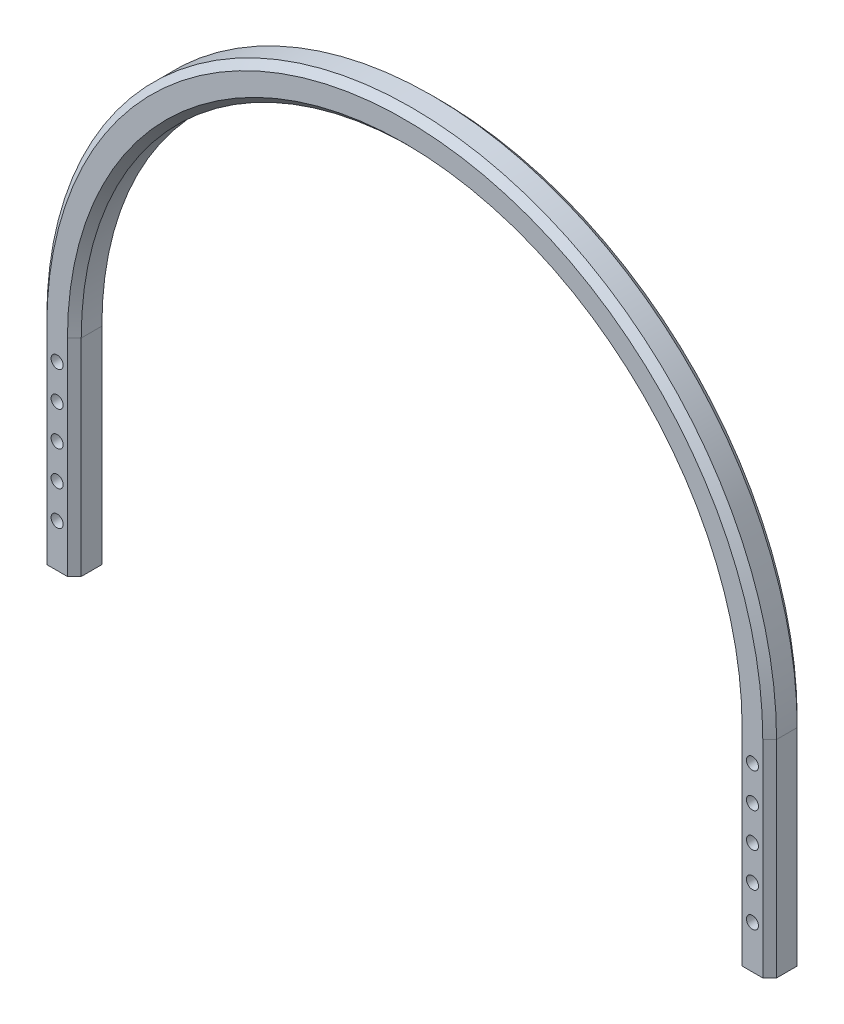
ISO-10303-21;
HEADER;
FILE_DESCRIPTION(('STEP AP214'),'2;1');
FILE_NAME('part.step','',(''),(''),'','','');
FILE_SCHEMA(('AUTOMOTIVE_DESIGN { 1 0 10303 214 1 1 1 1 }'));
ENDSEC;
DATA;
#1=APPLICATION_CONTEXT('core data for automotive mechanical design processes');
#2=APPLICATION_PROTOCOL_DEFINITION('international standard','automotive_design',2000,#1);
#3=PRODUCT_CONTEXT('',#1,'mechanical');
#4=PRODUCT('Part','Part','',(#3));
#5=PRODUCT_RELATED_PRODUCT_CATEGORY('part','',(#4));
#6=PRODUCT_DEFINITION_FORMATION('','',#4);
#7=PRODUCT_DEFINITION_CONTEXT('part definition',#1,'design');
#8=PRODUCT_DEFINITION('design','',#6,#7);
#9=PRODUCT_DEFINITION_SHAPE('','',#8);
#10=(LENGTH_UNIT() NAMED_UNIT(*) SI_UNIT(.MILLI.,.METRE.));
#11=(NAMED_UNIT(*) PLANE_ANGLE_UNIT() SI_UNIT($,.RADIAN.));
#12=(NAMED_UNIT(*) SI_UNIT($,.STERADIAN.) SOLID_ANGLE_UNIT());
#13=UNCERTAINTY_MEASURE_WITH_UNIT(LENGTH_MEASURE(1.E-05),#10,'distance_accuracy_value','');
#14=(GEOMETRIC_REPRESENTATION_CONTEXT(3) GLOBAL_UNCERTAINTY_ASSIGNED_CONTEXT((#13)) GLOBAL_UNIT_ASSIGNED_CONTEXT((#10,
#11,#12)) REPRESENTATION_CONTEXT('',''));
#15=CARTESIAN_POINT('',(0.,0.,0.));
#16=DIRECTION('',(0.,0.,1.));
#17=DIRECTION('',(1.,0.,0.));
#18=AXIS2_PLACEMENT_3D('',#15,#16,#17);
#19=CARTESIAN_POINT('',(101.,52.5,0.));
#20=DIRECTION('',(0.,0.,1.));
#21=DIRECTION('',(1.,0.,0.));
#22=AXIS2_PLACEMENT_3D('',#19,#20,#21);
#23=CYLINDRICAL_SURFACE('',#22,1.75);
#24=CARTESIAN_POINT('',(101.,52.5,0.));
#25=DIRECTION('',(0.,0.,1.));
#26=DIRECTION('',(-1.,0.,0.));
#27=AXIS2_PLACEMENT_3D('',#24,#25,#26);
#28=CIRCLE('',#27,1.75);
#29=CARTESIAN_POINT('',(99.25,52.5,0.));
#30=VERTEX_POINT('',#29);
#31=EDGE_CURVE('E48',#30,#30,#28,.T.);
#32=ORIENTED_EDGE('',*,*,#31,.F.);
#33=EDGE_LOOP('',(#32));
#34=FACE_BOUND('',#33,.T.);
#35=CARTESIAN_POINT('',(101.,52.5,10.));
#36=DIRECTION('',(0.,0.,1.));
#37=DIRECTION('',(-1.,0.,0.));
#38=AXIS2_PLACEMENT_3D('',#35,#36,#37);
#39=CIRCLE('',#38,1.75);
#40=CARTESIAN_POINT('',(99.25,52.5,10.));
#41=VERTEX_POINT('',#40);
#42=EDGE_CURVE('E11',#41,#41,#39,.T.);
#43=ORIENTED_EDGE('',*,*,#42,.T.);
#44=EDGE_LOOP('',(#43));
#45=FACE_BOUND('',#44,.T.);
#46=ADVANCED_FACE('F41',(#34,#45),#23,.F.);
#47=CARTESIAN_POINT('',(101.,42.5,0.));
#48=DIRECTION('',(0.,0.,1.));
#49=DIRECTION('',(1.,0.,0.));
#50=AXIS2_PLACEMENT_3D('',#47,#48,#49);
#51=CYLINDRICAL_SURFACE('',#50,1.75);
#52=CARTESIAN_POINT('',(101.,42.5,0.));
#53=DIRECTION('',(0.,0.,1.));
#54=DIRECTION('',(-1.,0.,0.));
#55=AXIS2_PLACEMENT_3D('',#52,#53,#54);
#56=CIRCLE('',#55,1.75);
#57=CARTESIAN_POINT('',(99.25,42.5,0.));
#58=VERTEX_POINT('',#57);
#59=EDGE_CURVE('E223',#58,#58,#56,.T.);
#60=ORIENTED_EDGE('',*,*,#59,.F.);
#61=EDGE_LOOP('',(#60));
#62=FACE_BOUND('',#61,.T.);
#63=CARTESIAN_POINT('',(101.,42.5,10.));
#64=DIRECTION('',(0.,0.,1.));
#65=DIRECTION('',(-1.,0.,0.));
#66=AXIS2_PLACEMENT_3D('',#63,#64,#65);
#67=CIRCLE('',#66,1.75);
#68=CARTESIAN_POINT('',(99.25,42.5,10.));
#69=VERTEX_POINT('',#68);
#70=EDGE_CURVE('E226',#69,#69,#67,.T.);
#71=ORIENTED_EDGE('',*,*,#70,.T.);
#72=EDGE_LOOP('',(#71));
#73=FACE_BOUND('',#72,.T.);
#74=ADVANCED_FACE('F235',(#62,#73),#51,.F.);
#75=CARTESIAN_POINT('',(101.,32.5,0.));
#76=DIRECTION('',(0.,0.,1.));
#77=DIRECTION('',(1.,0.,0.));
#78=AXIS2_PLACEMENT_3D('',#75,#76,#77);
#79=CYLINDRICAL_SURFACE('',#78,1.75);
#80=CARTESIAN_POINT('',(101.,32.5,0.));
#81=DIRECTION('',(0.,0.,1.));
#82=DIRECTION('',(-1.,0.,0.));
#83=AXIS2_PLACEMENT_3D('',#80,#81,#82);
#84=CIRCLE('',#83,1.75);
#85=CARTESIAN_POINT('',(99.25,32.5,0.));
#86=VERTEX_POINT('',#85);
#87=EDGE_CURVE('E217',#86,#86,#84,.T.);
#88=ORIENTED_EDGE('',*,*,#87,.F.);
#89=EDGE_LOOP('',(#88));
#90=FACE_BOUND('',#89,.T.);
#91=CARTESIAN_POINT('',(101.,32.5,10.));
#92=DIRECTION('',(0.,0.,1.));
#93=DIRECTION('',(-1.,0.,0.));
#94=AXIS2_PLACEMENT_3D('',#91,#92,#93);
#95=CIRCLE('',#94,1.75);
#96=CARTESIAN_POINT('',(99.25,32.5,10.));
#97=VERTEX_POINT('',#96);
#98=EDGE_CURVE('E220',#97,#97,#95,.T.);
#99=ORIENTED_EDGE('',*,*,#98,.T.);
#100=EDGE_LOOP('',(#99));
#101=FACE_BOUND('',#100,.T.);
#102=ADVANCED_FACE('F372',(#90,#101),#79,.F.);
#103=CARTESIAN_POINT('',(-101.,52.5,0.));
#104=DIRECTION('',(0.,0.,1.));
#105=DIRECTION('',(1.,0.,0.));
#106=AXIS2_PLACEMENT_3D('',#103,#104,#105);
#107=CYLINDRICAL_SURFACE('',#106,1.75);
#108=CARTESIAN_POINT('',(-101.,52.5,0.));
#109=DIRECTION('',(0.,0.,1.));
#110=DIRECTION('',(1.,0.,0.));
#111=AXIS2_PLACEMENT_3D('',#108,#109,#110);
#112=CIRCLE('',#111,1.75);
#113=CARTESIAN_POINT('',(-99.25,52.5,0.));
#114=VERTEX_POINT('',#113);
#115=EDGE_CURVE('E211',#114,#114,#112,.T.);
#116=ORIENTED_EDGE('',*,*,#115,.F.);
#117=EDGE_LOOP('',(#116));
#118=FACE_BOUND('',#117,.T.);
#119=CARTESIAN_POINT('',(-101.,52.5,10.));
#120=DIRECTION('',(0.,0.,1.));
#121=DIRECTION('',(1.,0.,0.));
#122=AXIS2_PLACEMENT_3D('',#119,#120,#121);
#123=CIRCLE('',#122,1.75);
#124=CARTESIAN_POINT('',(-99.25,52.5,10.));
#125=VERTEX_POINT('',#124);
#126=EDGE_CURVE('E214',#125,#125,#123,.T.);
#127=ORIENTED_EDGE('',*,*,#126,.T.);
#128=EDGE_LOOP('',(#127));
#129=FACE_BOUND('',#128,.T.);
#130=ADVANCED_FACE('F368',(#118,#129),#107,.F.);
#131=CARTESIAN_POINT('',(-101.,42.5,0.));
#132=DIRECTION('',(0.,0.,1.));
#133=DIRECTION('',(1.,0.,0.));
#134=AXIS2_PLACEMENT_3D('',#131,#132,#133);
#135=CYLINDRICAL_SURFACE('',#134,1.75);
#136=CARTESIAN_POINT('',(-101.,42.5,0.));
#137=DIRECTION('',(0.,0.,1.));
#138=DIRECTION('',(1.,0.,0.));
#139=AXIS2_PLACEMENT_3D('',#136,#137,#138);
#140=CIRCLE('',#139,1.75);
#141=CARTESIAN_POINT('',(-99.25,42.5,0.));
#142=VERTEX_POINT('',#141);
#143=EDGE_CURVE('E205',#142,#142,#140,.T.);
#144=ORIENTED_EDGE('',*,*,#143,.F.);
#145=EDGE_LOOP('',(#144));
#146=FACE_BOUND('',#145,.T.);
#147=CARTESIAN_POINT('',(-101.,42.5,10.));
#148=DIRECTION('',(0.,0.,1.));
#149=DIRECTION('',(1.,0.,0.));
#150=AXIS2_PLACEMENT_3D('',#147,#148,#149);
#151=CIRCLE('',#150,1.75);
#152=CARTESIAN_POINT('',(-99.25,42.5,10.));
#153=VERTEX_POINT('',#152);
#154=EDGE_CURVE('E208',#153,#153,#151,.T.);
#155=ORIENTED_EDGE('',*,*,#154,.T.);
#156=EDGE_LOOP('',(#155));
#157=FACE_BOUND('',#156,.T.);
#158=ADVANCED_FACE('F364',(#146,#157),#135,.F.);
#159=CARTESIAN_POINT('',(-101.,32.5,0.));
#160=DIRECTION('',(0.,0.,1.));
#161=DIRECTION('',(1.,0.,0.));
#162=AXIS2_PLACEMENT_3D('',#159,#160,#161);
#163=CYLINDRICAL_SURFACE('',#162,1.75);
#164=CARTESIAN_POINT('',(-101.,32.5,0.));
#165=DIRECTION('',(0.,0.,1.));
#166=DIRECTION('',(1.,0.,0.));
#167=AXIS2_PLACEMENT_3D('',#164,#165,#166);
#168=CIRCLE('',#167,1.75);
#169=CARTESIAN_POINT('',(-99.25,32.5,0.));
#170=VERTEX_POINT('',#169);
#171=EDGE_CURVE('E198',#170,#170,#168,.T.);
#172=ORIENTED_EDGE('',*,*,#171,.F.);
#173=EDGE_LOOP('',(#172));
#174=FACE_BOUND('',#173,.T.);
#175=CARTESIAN_POINT('',(-101.,32.5,10.));
#176=DIRECTION('',(0.,0.,1.));
#177=DIRECTION('',(1.,0.,0.));
#178=AXIS2_PLACEMENT_3D('',#175,#176,#177);
#179=CIRCLE('',#178,1.75);
#180=CARTESIAN_POINT('',(-99.25,32.5,10.));
#181=VERTEX_POINT('',#180);
#182=EDGE_CURVE('E201',#181,#181,#179,.T.);
#183=ORIENTED_EDGE('',*,*,#182,.T.);
#184=EDGE_LOOP('',(#183));
#185=FACE_BOUND('',#184,.T.);
#186=ADVANCED_FACE('F281',(#174,#185),#163,.F.);
#187=CARTESIAN_POINT('',(-106.,0.,10.));
#188=DIRECTION('',(0.,1.,0.));
#189=DIRECTION('',(0.,0.,1.));
#190=AXIS2_PLACEMENT_3D('',#187,#188,#189);
#191=PLANE('',#190);
#192=CARTESIAN_POINT('',(-101.,0.,5.));
#193=DIRECTION('',(0.,-1.,0.));
#194=DIRECTION('',(0.,0.,-1.));
#195=AXIS2_PLACEMENT_3D('',#192,#193,#194);
#196=CIRCLE('',#195,1.5);
#197=CARTESIAN_POINT('',(-101.,0.,3.5));
#198=VERTEX_POINT('',#197);
#199=EDGE_CURVE('E648',#198,#198,#196,.T.);
#200=ORIENTED_EDGE('',*,*,#199,.F.);
#201=EDGE_LOOP('',(#200));
#202=FACE_BOUND('',#201,.T.);
#203=DIRECTION('',(1.,0.,0.));
#204=VECTOR('',#203,1.);
#205=CARTESIAN_POINT('',(-106.,0.,0.));
#206=LINE('',#205,#204);
#207=CARTESIAN_POINT('',(-104.,0.,0.));
#208=VERTEX_POINT('',#207);
#209=CARTESIAN_POINT('',(-98.,0.,0.));
#210=VERTEX_POINT('',#209);
#211=EDGE_CURVE('E689',#208,#210,#206,.T.);
#212=ORIENTED_EDGE('',*,*,#211,.T.);
#213=DIRECTION('',(0.707106781186548,0.,0.707106781186548));
#214=VECTOR('',#213,1.);
#215=CARTESIAN_POINT('',(-96.,0.,2.));
#216=LINE('',#215,#214);
#217=CARTESIAN_POINT('',(-96.,0.,2.));
#218=VERTEX_POINT('',#217);
#219=EDGE_CURVE('E166',#210,#218,#216,.T.);
#220=ORIENTED_EDGE('',*,*,#219,.T.);
#221=DIRECTION('',(0.,0.,-1.));
#222=VECTOR('',#221,1.);
#223=CARTESIAN_POINT('',(-96.,0.,10.));
#224=LINE('',#223,#222);
#225=CARTESIAN_POINT('',(-96.,0.,8.));
#226=VERTEX_POINT('',#225);
#227=EDGE_CURVE('E176',#226,#218,#224,.T.);
#228=ORIENTED_EDGE('',*,*,#227,.F.);
#229=DIRECTION('',(0.707106781186543,0.,-0.707106781186552));
#230=VECTOR('',#229,1.);
#231=CARTESIAN_POINT('',(-98.,0.,10.));
#232=LINE('',#231,#230);
#233=CARTESIAN_POINT('',(-98.,0.,10.));
#234=VERTEX_POINT('',#233);
#235=EDGE_CURVE('E180',#226,#234,#232,.F.);
#236=ORIENTED_EDGE('',*,*,#235,.T.);
#237=DIRECTION('',(1.,0.,0.));
#238=VECTOR('',#237,1.);
#239=CARTESIAN_POINT('',(-106.,0.,10.));
#240=LINE('',#239,#238);
#241=CARTESIAN_POINT('',(-104.,0.,10.));
#242=VERTEX_POINT('',#241);
#243=EDGE_CURVE('E681',#242,#234,#240,.T.);
#244=ORIENTED_EDGE('',*,*,#243,.F.);
#245=DIRECTION('',(0.707106781186543,0.,0.707106781186552));
#246=VECTOR('',#245,1.);
#247=CARTESIAN_POINT('',(-104.,0.,10.));
#248=LINE('',#247,#246);
#249=CARTESIAN_POINT('',(-106.,0.,8.));
#250=VERTEX_POINT('',#249);
#251=EDGE_CURVE('E724',#242,#250,#248,.F.);
#252=ORIENTED_EDGE('',*,*,#251,.T.);
#253=DIRECTION('',(0.,0.,-1.));
#254=VECTOR('',#253,1.);
#255=CARTESIAN_POINT('',(-106.,0.,10.));
#256=LINE('',#255,#254);
#257=CARTESIAN_POINT('',(-106.,0.,2.));
#258=VERTEX_POINT('',#257);
#259=EDGE_CURVE('E688',#250,#258,#256,.T.);
#260=ORIENTED_EDGE('',*,*,#259,.T.);
#261=DIRECTION('',(0.707106781186548,0.,-0.707106781186548));
#262=VECTOR('',#261,1.);
#263=CARTESIAN_POINT('',(-106.,0.,2.));
#264=LINE('',#263,#262);
#265=EDGE_CURVE('E727',#258,#208,#264,.T.);
#266=ORIENTED_EDGE('',*,*,#265,.T.);
#267=EDGE_LOOP('',(#212,#220,#228,#236,#244,#252,#260,#266));
#268=FACE_BOUND('',#267,.T.);
#269=ADVANCED_FACE('F278',(#202,#268),#191,.F.);
#270=CARTESIAN_POINT('',(-96.,0.,10.));
#271=DIRECTION('',(-1.,0.,0.));
#272=DIRECTION('',(0.,0.,1.));
#273=AXIS2_PLACEMENT_3D('',#270,#271,#272);
#274=PLANE('',#273);
#275=ORIENTED_EDGE('',*,*,#227,.T.);
#276=DIRECTION('',(0.,1.,0.));
#277=VECTOR('',#276,1.);
#278=CARTESIAN_POINT('',(-96.,60.,2.));
#279=LINE('',#278,#277);
#280=CARTESIAN_POINT('',(-96.,60.,2.));
#281=VERTEX_POINT('',#280);
#282=EDGE_CURVE('E175',#218,#281,#279,.T.);
#283=ORIENTED_EDGE('',*,*,#282,.T.);
#284=DIRECTION('',(0.,0.,-1.));
#285=VECTOR('',#284,1.);
#286=CARTESIAN_POINT('',(-96.,60.,10.));
#287=LINE('',#286,#285);
#288=CARTESIAN_POINT('',(-96.,60.,8.));
#289=VERTEX_POINT('',#288);
#290=EDGE_CURVE('E159',#289,#281,#287,.T.);
#291=ORIENTED_EDGE('',*,*,#290,.F.);
#292=DIRECTION('',(0.,-1.,0.));
#293=VECTOR('',#292,1.);
#294=CARTESIAN_POINT('',(-96.,0.,8.));
#295=LINE('',#294,#293);
#296=EDGE_CURVE('E172',#289,#226,#295,.T.);
#297=ORIENTED_EDGE('',*,*,#296,.T.);
#298=EDGE_LOOP('',(#275,#283,#291,#297));
#299=FACE_BOUND('',#298,.T.);
#300=ADVANCED_FACE('F171',(#299),#274,.F.);
#301=CARTESIAN_POINT('',(0.,60.,10.));
#302=DIRECTION('',(0.,0.,-1.));
#303=DIRECTION('',(-1.,0.,0.));
#304=AXIS2_PLACEMENT_3D('',#301,#302,#303);
#305=CYLINDRICAL_SURFACE('',#304,96.);
#306=ORIENTED_EDGE('',*,*,#290,.T.);
#307=CARTESIAN_POINT('',(0.,60.,2.));
#308=DIRECTION('',(0.,0.,-1.));
#309=DIRECTION('',(-1.,0.,0.));
#310=AXIS2_PLACEMENT_3D('',#307,#308,#309);
#311=CIRCLE('',#310,96.);
#312=CARTESIAN_POINT('',(96.,60.,2.));
#313=VERTEX_POINT('',#312);
#314=EDGE_CURVE('E165',#281,#313,#311,.T.);
#315=ORIENTED_EDGE('',*,*,#314,.T.);
#316=DIRECTION('',(0.,0.,-1.));
#317=VECTOR('',#316,1.);
#318=CARTESIAN_POINT('',(96.,60.,10.));
#319=LINE('',#318,#317);
#320=CARTESIAN_POINT('',(96.,60.,8.));
#321=VERTEX_POINT('',#320);
#322=EDGE_CURVE('E161',#321,#313,#319,.T.);
#323=ORIENTED_EDGE('',*,*,#322,.F.);
#324=CARTESIAN_POINT('',(0.,60.,8.));
#325=DIRECTION('',(0.,0.,-1.));
#326=DIRECTION('',(-1.,0.,0.));
#327=AXIS2_PLACEMENT_3D('',#324,#325,#326);
#328=CIRCLE('',#327,96.);
#329=EDGE_CURVE('E156',#321,#289,#328,.F.);
#330=ORIENTED_EDGE('',*,*,#329,.T.);
#331=EDGE_LOOP('',(#306,#315,#323,#330));
#332=FACE_BOUND('',#331,.T.);
#333=ADVANCED_FACE('F158',(#332),#305,.F.);
#334=CARTESIAN_POINT('',(96.,60.,10.));
#335=DIRECTION('',(1.,0.,0.));
#336=DIRECTION('',(0.,0.,-1.));
#337=AXIS2_PLACEMENT_3D('',#334,#335,#336);
#338=PLANE('',#337);
#339=ORIENTED_EDGE('',*,*,#322,.T.);
#340=DIRECTION('',(0.,-1.,0.));
#341=VECTOR('',#340,1.);
#342=CARTESIAN_POINT('',(96.,0.,2.));
#343=LINE('',#342,#341);
#344=CARTESIAN_POINT('',(96.,0.,2.));
#345=VERTEX_POINT('',#344);
#346=EDGE_CURVE('E733',#313,#345,#343,.T.);
#347=ORIENTED_EDGE('',*,*,#346,.T.);
#348=DIRECTION('',(0.,0.,-1.));
#349=VECTOR('',#348,1.);
#350=CARTESIAN_POINT('',(96.,0.,10.));
#351=LINE('',#350,#349);
#352=CARTESIAN_POINT('',(96.,0.,8.));
#353=VERTEX_POINT('',#352);
#354=EDGE_CURVE('E706',#353,#345,#351,.T.);
#355=ORIENTED_EDGE('',*,*,#354,.F.);
#356=DIRECTION('',(0.,1.,0.));
#357=VECTOR('',#356,1.);
#358=CARTESIAN_POINT('',(96.,60.,8.));
#359=LINE('',#358,#357);
#360=EDGE_CURVE('E731',#353,#321,#359,.T.);
#361=ORIENTED_EDGE('',*,*,#360,.T.);
#362=EDGE_LOOP('',(#339,#347,#355,#361));
#363=FACE_BOUND('',#362,.T.);
#364=ADVANCED_FACE('F269',(#363),#338,.F.);
#365=CARTESIAN_POINT('',(96.,0.,10.));
#366=DIRECTION('',(0.,1.,0.));
#367=DIRECTION('',(-1.,0.,0.));
#368=AXIS2_PLACEMENT_3D('',#365,#366,#367);
#369=PLANE('',#368);
#370=CARTESIAN_POINT('',(101.,0.,5.));
#371=DIRECTION('',(0.,-1.,0.));
#372=DIRECTION('',(0.,0.,1.));
#373=AXIS2_PLACEMENT_3D('',#370,#371,#372);
#374=CIRCLE('',#373,1.5);
#375=CARTESIAN_POINT('',(101.,0.,6.5));
#376=VERTEX_POINT('',#375);
#377=EDGE_CURVE('E654',#376,#376,#374,.T.);
#378=ORIENTED_EDGE('',*,*,#377,.F.);
#379=EDGE_LOOP('',(#378));
#380=FACE_BOUND('',#379,.T.);
#381=ORIENTED_EDGE('',*,*,#354,.T.);
#382=DIRECTION('',(0.707106781186548,0.,-0.707106781186548));
#383=VECTOR('',#382,1.);
#384=CARTESIAN_POINT('',(96.,0.,2.00000000000001));
#385=LINE('',#384,#383);
#386=CARTESIAN_POINT('',(98.,0.,0.));
#387=VERTEX_POINT('',#386);
#388=EDGE_CURVE('E741',#345,#387,#385,.T.);
#389=ORIENTED_EDGE('',*,*,#388,.T.);
#390=DIRECTION('',(1.,0.,0.));
#391=VECTOR('',#390,1.);
#392=CARTESIAN_POINT('',(96.,0.,0.));
#393=LINE('',#392,#391);
#394=CARTESIAN_POINT('',(104.,0.,0.));
#395=VERTEX_POINT('',#394);
#396=EDGE_CURVE('E685',#387,#395,#393,.T.);
#397=ORIENTED_EDGE('',*,*,#396,.T.);
#398=DIRECTION('',(0.707106781186548,0.,0.707106781186548));
#399=VECTOR('',#398,1.);
#400=CARTESIAN_POINT('',(106.,0.,1.99999999999999));
#401=LINE('',#400,#399);
#402=CARTESIAN_POINT('',(106.,0.,2.));
#403=VERTEX_POINT('',#402);
#404=EDGE_CURVE('E739',#395,#403,#401,.T.);
#405=ORIENTED_EDGE('',*,*,#404,.T.);
#406=DIRECTION('',(0.,0.,-1.));
#407=VECTOR('',#406,1.);
#408=CARTESIAN_POINT('',(106.,0.,10.));
#409=LINE('',#408,#407);
#410=CARTESIAN_POINT('',(106.,0.,8.));
#411=VERTEX_POINT('',#410);
#412=EDGE_CURVE('E703',#411,#403,#409,.T.);
#413=ORIENTED_EDGE('',*,*,#412,.F.);
#414=DIRECTION('',(0.707106781186543,0.,-0.707106781186552));
#415=VECTOR('',#414,1.);
#416=CARTESIAN_POINT('',(104.,0.,10.));
#417=LINE('',#416,#415);
#418=CARTESIAN_POINT('',(104.,0.,10.));
#419=VERTEX_POINT('',#418);
#420=EDGE_CURVE('E735',#411,#419,#417,.F.);
#421=ORIENTED_EDGE('',*,*,#420,.T.);
#422=DIRECTION('',(1.,0.,0.));
#423=VECTOR('',#422,1.);
#424=CARTESIAN_POINT('',(96.,0.,10.));
#425=LINE('',#424,#423);
#426=CARTESIAN_POINT('',(98.,0.,10.));
#427=VERTEX_POINT('',#426);
#428=EDGE_CURVE('E684',#427,#419,#425,.T.);
#429=ORIENTED_EDGE('',*,*,#428,.F.);
#430=DIRECTION('',(0.707106781186543,0.,0.707106781186552));
#431=VECTOR('',#430,1.);
#432=CARTESIAN_POINT('',(98.,0.,9.99999999999999));
#433=LINE('',#432,#431);
#434=EDGE_CURVE('E737',#427,#353,#433,.F.);
#435=ORIENTED_EDGE('',*,*,#434,.T.);
#436=EDGE_LOOP('',(#381,#389,#397,#405,#413,#421,#429,#435));
#437=FACE_BOUND('',#436,.T.);
#438=ADVANCED_FACE('F265',(#380,#437),#369,.F.);
#439=CARTESIAN_POINT('',(106.,60.,10.));
#440=DIRECTION('',(-1.,0.,0.));
#441=DIRECTION('',(0.,0.,1.));
#442=AXIS2_PLACEMENT_3D('',#439,#440,#441);
#443=PLANE('',#442);
#444=ORIENTED_EDGE('',*,*,#412,.T.);
#445=DIRECTION('',(0.,1.,0.));
#446=VECTOR('',#445,1.);
#447=CARTESIAN_POINT('',(106.,60.0000000000001,2.));
#448=LINE('',#447,#446);
#449=CARTESIAN_POINT('',(106.,60.0000000000001,2.));
#450=VERTEX_POINT('',#449);
#451=EDGE_CURVE('E754',#403,#450,#448,.T.);
#452=ORIENTED_EDGE('',*,*,#451,.T.);
#453=DIRECTION('',(0.,0.,-1.));
#454=VECTOR('',#453,1.);
#455=CARTESIAN_POINT('',(106.,60.0000000000001,10.));
#456=LINE('',#455,#454);
#457=CARTESIAN_POINT('',(106.,60.0000000000001,8.));
#458=VERTEX_POINT('',#457);
#459=EDGE_CURVE('E700',#458,#450,#456,.T.);
#460=ORIENTED_EDGE('',*,*,#459,.F.);
#461=DIRECTION('',(0.,-1.,0.));
#462=VECTOR('',#461,1.);
#463=CARTESIAN_POINT('',(106.,60.,8.));
#464=LINE('',#463,#462);
#465=EDGE_CURVE('E752',#458,#411,#464,.T.);
#466=ORIENTED_EDGE('',*,*,#465,.T.);
#467=EDGE_LOOP('',(#444,#452,#460,#466));
#468=FACE_BOUND('',#467,.T.);
#469=ADVANCED_FACE('F261',(#468),#443,.F.);
#470=CARTESIAN_POINT('',(0.,60.,10.));
#471=DIRECTION('',(0.,0.,-1.));
#472=DIRECTION('',(-1.,0.,0.));
#473=AXIS2_PLACEMENT_3D('',#470,#471,#472);
#474=CYLINDRICAL_SURFACE('',#473,106.);
#475=ORIENTED_EDGE('',*,*,#459,.T.);
#476=CARTESIAN_POINT('',(0.,60.,2.));
#477=DIRECTION('',(0.,0.,-1.));
#478=DIRECTION('',(-1.,0.,0.));
#479=AXIS2_PLACEMENT_3D('',#476,#477,#478);
#480=CIRCLE('',#479,106.);
#481=CARTESIAN_POINT('',(-106.,60.,2.));
#482=VERTEX_POINT('',#481);
#483=EDGE_CURVE('E750',#450,#482,#480,.F.);
#484=ORIENTED_EDGE('',*,*,#483,.T.);
#485=DIRECTION('',(0.,0.,-1.));
#486=VECTOR('',#485,1.);
#487=CARTESIAN_POINT('',(-106.,60.,10.));
#488=LINE('',#487,#486);
#489=CARTESIAN_POINT('',(-106.,60.,8.));
#490=VERTEX_POINT('',#489);
#491=EDGE_CURVE('E697',#490,#482,#488,.T.);
#492=ORIENTED_EDGE('',*,*,#491,.F.);
#493=CARTESIAN_POINT('',(0.,60.,8.));
#494=DIRECTION('',(0.,0.,-1.));
#495=DIRECTION('',(-1.,0.,0.));
#496=AXIS2_PLACEMENT_3D('',#493,#494,#495);
#497=CIRCLE('',#496,106.);
#498=EDGE_CURVE('E748',#490,#458,#497,.T.);
#499=ORIENTED_EDGE('',*,*,#498,.T.);
#500=EDGE_LOOP('',(#475,#484,#492,#499));
#501=FACE_BOUND('',#500,.T.);
#502=ADVANCED_FACE('F250',(#501),#474,.T.);
#503=CARTESIAN_POINT('',(-106.,0.,10.));
#504=DIRECTION('',(1.,0.,0.));
#505=DIRECTION('',(0.,0.,-1.));
#506=AXIS2_PLACEMENT_3D('',#503,#504,#505);
#507=PLANE('',#506);
#508=ORIENTED_EDGE('',*,*,#491,.T.);
#509=DIRECTION('',(0.,-1.,0.));
#510=VECTOR('',#509,1.);
#511=CARTESIAN_POINT('',(-106.,0.,2.));
#512=LINE('',#511,#510);
#513=EDGE_CURVE('E745',#482,#258,#512,.T.);
#514=ORIENTED_EDGE('',*,*,#513,.T.);
#515=ORIENTED_EDGE('',*,*,#259,.F.);
#516=DIRECTION('',(0.,1.,0.));
#517=VECTOR('',#516,1.);
#518=CARTESIAN_POINT('',(-106.,0.,8.));
#519=LINE('',#518,#517);
#520=EDGE_CURVE('E743',#250,#490,#519,.T.);
#521=ORIENTED_EDGE('',*,*,#520,.T.);
#522=EDGE_LOOP('',(#508,#514,#515,#521));
#523=FACE_BOUND('',#522,.T.);
#524=ADVANCED_FACE('F240',(#523),#507,.F.);
#525=CARTESIAN_POINT('',(0.,60.,10.));
#526=DIRECTION('',(0.,0.,-1.));
#527=DIRECTION('',(-1.,0.,0.));
#528=AXIS2_PLACEMENT_3D('',#525,#526,#527);
#529=PLANE('',#528);
#530=CARTESIAN_POINT('',(101.,22.5,10.));
#531=DIRECTION('',(0.,0.,1.));
#532=DIRECTION('',(-1.,0.,0.));
#533=AXIS2_PLACEMENT_3D('',#530,#531,#532);
#534=CIRCLE('',#533,1.75);
#535=CARTESIAN_POINT('',(99.25,22.5,10.));
#536=VERTEX_POINT('',#535);
#537=EDGE_CURVE('E651',#536,#536,#534,.T.);
#538=ORIENTED_EDGE('',*,*,#537,.F.);
#539=EDGE_LOOP('',(#538));
#540=FACE_BOUND('',#539,.T.);
#541=CARTESIAN_POINT('',(-101.,22.5,10.));
#542=DIRECTION('',(0.,0.,1.));
#543=DIRECTION('',(1.,0.,0.));
#544=AXIS2_PLACEMENT_3D('',#541,#542,#543);
#545=CIRCLE('',#544,1.75);
#546=CARTESIAN_POINT('',(-99.25,22.5,10.));
#547=VERTEX_POINT('',#546);
#548=EDGE_CURVE('E667',#547,#547,#545,.T.);
#549=ORIENTED_EDGE('',*,*,#548,.F.);
#550=EDGE_LOOP('',(#549));
#551=FACE_BOUND('',#550,.T.);
#552=CARTESIAN_POINT('',(-101.,12.5,10.));
#553=DIRECTION('',(0.,0.,1.));
#554=DIRECTION('',(1.,0.,0.));
#555=AXIS2_PLACEMENT_3D('',#552,#553,#554);
#556=CIRCLE('',#555,1.75);
#557=CARTESIAN_POINT('',(-99.25,12.5,10.));
#558=VERTEX_POINT('',#557);
#559=EDGE_CURVE('E673',#558,#558,#556,.T.);
#560=ORIENTED_EDGE('',*,*,#559,.F.);
#561=EDGE_LOOP('',(#560));
#562=FACE_BOUND('',#561,.T.);
#563=CARTESIAN_POINT('',(101.,12.5,10.));
#564=DIRECTION('',(0.,0.,1.));
#565=DIRECTION('',(-1.,0.,0.));
#566=AXIS2_PLACEMENT_3D('',#563,#564,#565);
#567=CIRCLE('',#566,1.75);
#568=CARTESIAN_POINT('',(99.25,12.5,10.));
#569=VERTEX_POINT('',#568);
#570=EDGE_CURVE('E676',#569,#569,#567,.T.);
#571=ORIENTED_EDGE('',*,*,#570,.F.);
#572=EDGE_LOOP('',(#571));
#573=FACE_BOUND('',#572,.T.);
#574=ORIENTED_EDGE('',*,*,#243,.T.);
#575=DIRECTION('',(0.,1.,0.));
#576=VECTOR('',#575,1.);
#577=CARTESIAN_POINT('',(-98.,60.,10.));
#578=LINE('',#577,#576);
#579=CARTESIAN_POINT('',(-98.,60.,10.));
#580=VERTEX_POINT('',#579);
#581=EDGE_CURVE('E202',#234,#580,#578,.T.);
#582=ORIENTED_EDGE('',*,*,#581,.T.);
#583=CARTESIAN_POINT('',(0.,60.,10.));
#584=DIRECTION('',(0.,0.,-1.));
#585=DIRECTION('',(-1.,0.,0.));
#586=AXIS2_PLACEMENT_3D('',#583,#584,#585);
#587=CIRCLE('',#586,98.);
#588=CARTESIAN_POINT('',(98.,60.,10.));
#589=VERTEX_POINT('',#588);
#590=EDGE_CURVE('E62',#580,#589,#587,.T.);
#591=ORIENTED_EDGE('',*,*,#590,.T.);
#592=DIRECTION('',(0.,-1.,0.));
#593=VECTOR('',#592,1.);
#594=CARTESIAN_POINT('',(98.,60.,10.));
#595=LINE('',#594,#593);
#596=EDGE_CURVE('E763',#589,#427,#595,.T.);
#597=ORIENTED_EDGE('',*,*,#596,.T.);
#598=ORIENTED_EDGE('',*,*,#428,.T.);
#599=DIRECTION('',(0.,1.,0.));
#600=VECTOR('',#599,1.);
#601=CARTESIAN_POINT('',(104.,60.,10.));
#602=LINE('',#601,#600);
#603=CARTESIAN_POINT('',(104.,60.0000000000001,10.));
#604=VERTEX_POINT('',#603);
#605=EDGE_CURVE('E756',#419,#604,#602,.T.);
#606=ORIENTED_EDGE('',*,*,#605,.T.);
#607=CARTESIAN_POINT('',(0.,60.,10.));
#608=DIRECTION('',(0.,0.,-1.));
#609=DIRECTION('',(-1.,0.,0.));
#610=AXIS2_PLACEMENT_3D('',#607,#608,#609);
#611=CIRCLE('',#610,104.);
#612=CARTESIAN_POINT('',(-104.,60.,10.));
#613=VERTEX_POINT('',#612);
#614=EDGE_CURVE('E758',#604,#613,#611,.F.);
#615=ORIENTED_EDGE('',*,*,#614,.T.);
#616=DIRECTION('',(0.,-1.,0.));
#617=VECTOR('',#616,1.);
#618=CARTESIAN_POINT('',(-104.,60.,10.));
#619=LINE('',#618,#617);
#620=EDGE_CURVE('E760',#613,#242,#619,.T.);
#621=ORIENTED_EDGE('',*,*,#620,.T.);
#622=EDGE_LOOP('',(#574,#582,#591,#597,#598,#606,#615,#621));
#623=FACE_BOUND('',#622,.T.);
#624=ORIENTED_EDGE('',*,*,#182,.F.);
#625=EDGE_LOOP('',(#624));
#626=FACE_BOUND('',#625,.T.);
#627=ORIENTED_EDGE('',*,*,#154,.F.);
#628=EDGE_LOOP('',(#627));
#629=FACE_BOUND('',#628,.T.);
#630=ORIENTED_EDGE('',*,*,#126,.F.);
#631=EDGE_LOOP('',(#630));
#632=FACE_BOUND('',#631,.T.);
#633=ORIENTED_EDGE('',*,*,#98,.F.);
#634=EDGE_LOOP('',(#633));
#635=FACE_BOUND('',#634,.T.);
#636=ORIENTED_EDGE('',*,*,#70,.F.);
#637=EDGE_LOOP('',(#636));
#638=FACE_BOUND('',#637,.T.);
#639=ORIENTED_EDGE('',*,*,#42,.F.);
#640=EDGE_LOOP('',(#639));
#641=FACE_BOUND('',#640,.T.);
#642=ADVANCED_FACE('F238',(#540,#551,#562,#573,#623,#626,#629,#632,#635,#638,#641),#529,.F.);
#643=CARTESIAN_POINT('',(0.,60.,0.));
#644=DIRECTION('',(0.,0.,-1.));
#645=DIRECTION('',(-1.,0.,0.));
#646=AXIS2_PLACEMENT_3D('',#643,#644,#645);
#647=PLANE('',#646);
#648=CARTESIAN_POINT('',(101.,22.5,0.));
#649=DIRECTION('',(0.,0.,1.));
#650=DIRECTION('',(-1.,0.,0.));
#651=AXIS2_PLACEMENT_3D('',#648,#649,#650);
#652=CIRCLE('',#651,1.75);
#653=CARTESIAN_POINT('',(99.25,22.5,0.));
#654=VERTEX_POINT('',#653);
#655=EDGE_CURVE('E647',#654,#654,#652,.T.);
#656=ORIENTED_EDGE('',*,*,#655,.T.);
#657=EDGE_LOOP('',(#656));
#658=FACE_BOUND('',#657,.T.);
#659=CARTESIAN_POINT('',(-101.,22.5,0.));
#660=DIRECTION('',(0.,0.,1.));
#661=DIRECTION('',(1.,0.,0.));
#662=AXIS2_PLACEMENT_3D('',#659,#660,#661);
#663=CIRCLE('',#662,1.75);
#664=CARTESIAN_POINT('',(-99.25,22.5,0.));
#665=VERTEX_POINT('',#664);
#666=EDGE_CURVE('E664',#665,#665,#663,.T.);
#667=ORIENTED_EDGE('',*,*,#666,.T.);
#668=EDGE_LOOP('',(#667));
#669=FACE_BOUND('',#668,.T.);
#670=CARTESIAN_POINT('',(-101.,12.5,0.));
#671=DIRECTION('',(0.,0.,1.));
#672=DIRECTION('',(1.,0.,0.));
#673=AXIS2_PLACEMENT_3D('',#670,#671,#672);
#674=CIRCLE('',#673,1.75);
#675=CARTESIAN_POINT('',(-99.25,12.5,0.));
#676=VERTEX_POINT('',#675);
#677=EDGE_CURVE('E196',#676,#676,#674,.T.);
#678=ORIENTED_EDGE('',*,*,#677,.T.);
#679=EDGE_LOOP('',(#678));
#680=FACE_BOUND('',#679,.T.);
#681=CARTESIAN_POINT('',(101.,12.5,0.));
#682=DIRECTION('',(0.,0.,1.));
#683=DIRECTION('',(-1.,0.,0.));
#684=AXIS2_PLACEMENT_3D('',#681,#682,#683);
#685=CIRCLE('',#684,1.75);
#686=CARTESIAN_POINT('',(99.25,12.5,0.));
#687=VERTEX_POINT('',#686);
#688=EDGE_CURVE('E670',#687,#687,#685,.T.);
#689=ORIENTED_EDGE('',*,*,#688,.T.);
#690=EDGE_LOOP('',(#689));
#691=FACE_BOUND('',#690,.T.);
#692=CARTESIAN_POINT('',(0.,60.,0.));
#693=DIRECTION('',(0.,0.,-1.));
#694=DIRECTION('',(-1.,0.,0.));
#695=AXIS2_PLACEMENT_3D('',#692,#693,#694);
#696=CIRCLE('',#695,98.);
#697=CARTESIAN_POINT('',(98.,60.,0.));
#698=VERTEX_POINT('',#697);
#699=CARTESIAN_POINT('',(-98.,60.,0.));
#700=VERTEX_POINT('',#699);
#701=EDGE_CURVE('E720',#698,#700,#696,.F.);
#702=ORIENTED_EDGE('',*,*,#701,.T.);
#703=DIRECTION('',(0.,-1.,0.));
#704=VECTOR('',#703,1.);
#705=CARTESIAN_POINT('',(-98.,0.,0.));
#706=LINE('',#705,#704);
#707=EDGE_CURVE('E722',#700,#210,#706,.T.);
#708=ORIENTED_EDGE('',*,*,#707,.T.);
#709=ORIENTED_EDGE('',*,*,#211,.F.);
#710=DIRECTION('',(0.,1.,0.));
#711=VECTOR('',#710,1.);
#712=CARTESIAN_POINT('',(-104.,60.,0.));
#713=LINE('',#712,#711);
#714=CARTESIAN_POINT('',(-104.,60.,0.));
#715=VERTEX_POINT('',#714);
#716=EDGE_CURVE('E716',#208,#715,#713,.T.);
#717=ORIENTED_EDGE('',*,*,#716,.T.);
#718=CARTESIAN_POINT('',(0.,60.,0.));
#719=DIRECTION('',(0.,0.,-1.));
#720=DIRECTION('',(-1.,0.,0.));
#721=AXIS2_PLACEMENT_3D('',#718,#719,#720);
#722=CIRCLE('',#721,104.);
#723=CARTESIAN_POINT('',(104.,60.0000000000001,0.));
#724=VERTEX_POINT('',#723);
#725=EDGE_CURVE('E714',#715,#724,#722,.T.);
#726=ORIENTED_EDGE('',*,*,#725,.T.);
#727=DIRECTION('',(0.,-1.,0.));
#728=VECTOR('',#727,1.);
#729=CARTESIAN_POINT('',(104.,0.,0.));
#730=LINE('',#729,#728);
#731=EDGE_CURVE('E712',#724,#395,#730,.T.);
#732=ORIENTED_EDGE('',*,*,#731,.T.);
#733=ORIENTED_EDGE('',*,*,#396,.F.);
#734=DIRECTION('',(0.,1.,0.));
#735=VECTOR('',#734,1.);
#736=CARTESIAN_POINT('',(98.,60.,0.));
#737=LINE('',#736,#735);
#738=EDGE_CURVE('E718',#387,#698,#737,.T.);
#739=ORIENTED_EDGE('',*,*,#738,.T.);
#740=EDGE_LOOP('',(#702,#708,#709,#717,#726,#732,#733,#739));
#741=FACE_BOUND('',#740,.T.);
#742=ORIENTED_EDGE('',*,*,#171,.T.);
#743=EDGE_LOOP('',(#742));
#744=FACE_BOUND('',#743,.T.);
#745=ORIENTED_EDGE('',*,*,#143,.T.);
#746=EDGE_LOOP('',(#745));
#747=FACE_BOUND('',#746,.T.);
#748=ORIENTED_EDGE('',*,*,#115,.T.);
#749=EDGE_LOOP('',(#748));
#750=FACE_BOUND('',#749,.T.);
#751=ORIENTED_EDGE('',*,*,#87,.T.);
#752=EDGE_LOOP('',(#751));
#753=FACE_BOUND('',#752,.T.);
#754=ORIENTED_EDGE('',*,*,#59,.T.);
#755=EDGE_LOOP('',(#754));
#756=FACE_BOUND('',#755,.T.);
#757=ORIENTED_EDGE('',*,*,#31,.T.);
#758=EDGE_LOOP('',(#757));
#759=FACE_BOUND('',#758,.T.);
#760=ADVANCED_FACE('F231',(#658,#669,#680,#691,#741,#744,#747,#750,#753,#756,#759),#647,.T.);
#761=CARTESIAN_POINT('',(96.,60.,2.));
#762=DIRECTION('',(-0.707106781186547,0.,-0.707106781186547));
#763=DIRECTION('',(0.,1.,0.));
#764=AXIS2_PLACEMENT_3D('',#761,#762,#763);
#765=PLANE('',#764);
#766=ORIENTED_EDGE('',*,*,#388,.F.);
#767=ORIENTED_EDGE('',*,*,#346,.F.);
#768=DIRECTION('',(-0.707106781186547,0.,0.707106781186547));
#769=VECTOR('',#768,1.);
#770=CARTESIAN_POINT('',(98.,60.,0.));
#771=LINE('',#770,#769);
#772=EDGE_CURVE('E692',#698,#313,#771,.T.);
#773=ORIENTED_EDGE('',*,*,#772,.F.);
#774=ORIENTED_EDGE('',*,*,#738,.F.);
#775=EDGE_LOOP('',(#766,#767,#773,#774));
#776=FACE_BOUND('',#775,.T.);
#777=ADVANCED_FACE('F247',(#776),#765,.T.);
#778=CARTESIAN_POINT('',(0.,60.,2.));
#779=DIRECTION('',(0.,0.,-1.));
#780=DIRECTION('',(-1.,0.,0.));
#781=AXIS2_PLACEMENT_3D('',#778,#779,#780);
#782=CONICAL_SURFACE('',#781,96.,0.785398163397448);
#783=ORIENTED_EDGE('',*,*,#772,.T.);
#784=ORIENTED_EDGE('',*,*,#314,.F.);
#785=DIRECTION('',(0.707106781186547,0.,0.707106781186547));
#786=VECTOR('',#785,1.);
#787=CARTESIAN_POINT('',(-98.,60.,0.));
#788=LINE('',#787,#786);
#789=EDGE_CURVE('E767',#700,#281,#788,.T.);
#790=ORIENTED_EDGE('',*,*,#789,.F.);
#791=ORIENTED_EDGE('',*,*,#701,.F.);
#792=EDGE_LOOP('',(#783,#784,#790,#791));
#793=FACE_BOUND('',#792,.T.);
#794=ADVANCED_FACE('F292',(#793),#782,.F.);
#795=CARTESIAN_POINT('',(-96.,0.,2.));
#796=DIRECTION('',(0.707106781186547,0.,-0.707106781186547));
#797=DIRECTION('',(0.,-1.,0.));
#798=AXIS2_PLACEMENT_3D('',#795,#796,#797);
#799=PLANE('',#798);
#800=ORIENTED_EDGE('',*,*,#219,.F.);
#801=ORIENTED_EDGE('',*,*,#707,.F.);
#802=ORIENTED_EDGE('',*,*,#789,.T.);
#803=ORIENTED_EDGE('',*,*,#282,.F.);
#804=EDGE_LOOP('',(#800,#801,#802,#803));
#805=FACE_BOUND('',#804,.T.);
#806=ADVANCED_FACE('F284',(#805),#799,.T.);
#807=CARTESIAN_POINT('',(106.,60.,2.));
#808=DIRECTION('',(0.707106781186547,0.,-0.707106781186547));
#809=DIRECTION('',(0.,-1.,0.));
#810=AXIS2_PLACEMENT_3D('',#807,#808,#809);
#811=PLANE('',#810);
#812=ORIENTED_EDGE('',*,*,#404,.F.);
#813=ORIENTED_EDGE('',*,*,#731,.F.);
#814=DIRECTION('',(-0.707106781186547,0.,-0.707106781186547));
#815=VECTOR('',#814,1.);
#816=CARTESIAN_POINT('',(106.,60.0000000000001,2.));
#817=LINE('',#816,#815);
#818=EDGE_CURVE('E192',#450,#724,#817,.T.);
#819=ORIENTED_EDGE('',*,*,#818,.F.);
#820=ORIENTED_EDGE('',*,*,#451,.F.);
#821=EDGE_LOOP('',(#812,#813,#819,#820));
#822=FACE_BOUND('',#821,.T.);
#823=ADVANCED_FACE('F291',(#822),#811,.T.);
#824=CARTESIAN_POINT('',(0.,60.,2.));
#825=DIRECTION('',(0.,0.,1.));
#826=DIRECTION('',(1.,0.,0.));
#827=AXIS2_PLACEMENT_3D('',#824,#825,#826);
#828=CONICAL_SURFACE('',#827,106.,0.785398163397448);
#829=ORIENTED_EDGE('',*,*,#818,.T.);
#830=ORIENTED_EDGE('',*,*,#725,.F.);
#831=DIRECTION('',(0.707106781186547,0.,-0.707106781186547));
#832=VECTOR('',#831,1.);
#833=CARTESIAN_POINT('',(-106.,60.,2.));
#834=LINE('',#833,#832);
#835=EDGE_CURVE('E186',#482,#715,#834,.T.);
#836=ORIENTED_EDGE('',*,*,#835,.F.);
#837=ORIENTED_EDGE('',*,*,#483,.F.);
#838=EDGE_LOOP('',(#829,#830,#836,#837));
#839=FACE_BOUND('',#838,.T.);
#840=ADVANCED_FACE('F314',(#839),#828,.T.);
#841=CARTESIAN_POINT('',(-106.,0.,2.));
#842=DIRECTION('',(-0.707106781186547,0.,-0.707106781186547));
#843=DIRECTION('',(0.,1.,0.));
#844=AXIS2_PLACEMENT_3D('',#841,#842,#843);
#845=PLANE('',#844);
#846=ORIENTED_EDGE('',*,*,#835,.T.);
#847=ORIENTED_EDGE('',*,*,#716,.F.);
#848=ORIENTED_EDGE('',*,*,#265,.F.);
#849=ORIENTED_EDGE('',*,*,#513,.F.);
#850=EDGE_LOOP('',(#846,#847,#848,#849));
#851=FACE_BOUND('',#850,.T.);
#852=ADVANCED_FACE('F306',(#851),#845,.T.);
#853=CARTESIAN_POINT('',(98.,60.,10.));
#854=DIRECTION('',(0.707106781186552,0.,-0.707106781186543));
#855=DIRECTION('',(0.,-1.,0.));
#856=AXIS2_PLACEMENT_3D('',#853,#854,#855);
#857=PLANE('',#856);
#858=ORIENTED_EDGE('',*,*,#434,.F.);
#859=ORIENTED_EDGE('',*,*,#596,.F.);
#860=DIRECTION('',(0.707106781186543,0.,0.707106781186552));
#861=VECTOR('',#860,1.);
#862=CARTESIAN_POINT('',(96.,60.,8.));
#863=LINE('',#862,#861);
#864=EDGE_CURVE('E183',#321,#589,#863,.T.);
#865=ORIENTED_EDGE('',*,*,#864,.F.);
#866=ORIENTED_EDGE('',*,*,#360,.F.);
#867=EDGE_LOOP('',(#858,#859,#865,#866));
#868=FACE_BOUND('',#867,.T.);
#869=ADVANCED_FACE('F313',(#868),#857,.F.);
#870=CARTESIAN_POINT('',(0.,60.,10.));
#871=DIRECTION('',(0.,0.,1.));
#872=DIRECTION('',(1.,0.,0.));
#873=AXIS2_PLACEMENT_3D('',#870,#871,#872);
#874=CONICAL_SURFACE('',#873,98.,0.785398163397441);
#875=ORIENTED_EDGE('',*,*,#864,.T.);
#876=ORIENTED_EDGE('',*,*,#590,.F.);
#877=DIRECTION('',(-0.707106781186543,0.,0.707106781186552));
#878=VECTOR('',#877,1.);
#879=CARTESIAN_POINT('',(-96.,60.,8.));
#880=LINE('',#879,#878);
#881=EDGE_CURVE('E55',#289,#580,#880,.T.);
#882=ORIENTED_EDGE('',*,*,#881,.F.);
#883=ORIENTED_EDGE('',*,*,#329,.F.);
#884=EDGE_LOOP('',(#875,#876,#882,#883));
#885=FACE_BOUND('',#884,.T.);
#886=ADVANCED_FACE('F182',(#885),#874,.F.);
#887=CARTESIAN_POINT('',(-98.,60.,10.));
#888=DIRECTION('',(-0.707106781186552,0.,-0.707106781186543));
#889=DIRECTION('',(0.,1.,0.));
#890=AXIS2_PLACEMENT_3D('',#887,#888,#889);
#891=PLANE('',#890);
#892=ORIENTED_EDGE('',*,*,#235,.F.);
#893=ORIENTED_EDGE('',*,*,#296,.F.);
#894=ORIENTED_EDGE('',*,*,#881,.T.);
#895=ORIENTED_EDGE('',*,*,#581,.F.);
#896=EDGE_LOOP('',(#892,#893,#894,#895));
#897=FACE_BOUND('',#896,.T.);
#898=ADVANCED_FACE('F179',(#897),#891,.F.);
#899=CARTESIAN_POINT('',(104.,60.,10.));
#900=DIRECTION('',(-0.707106781186552,0.,-0.707106781186543));
#901=DIRECTION('',(0.,1.,0.));
#902=AXIS2_PLACEMENT_3D('',#899,#900,#901);
#903=PLANE('',#902);
#904=ORIENTED_EDGE('',*,*,#420,.F.);
#905=ORIENTED_EDGE('',*,*,#465,.F.);
#906=DIRECTION('',(0.707106781186543,0.,-0.707106781186552));
#907=VECTOR('',#906,1.);
#908=CARTESIAN_POINT('',(104.,60.0000000000001,10.));
#909=LINE('',#908,#907);
#910=EDGE_CURVE('E184',#604,#458,#909,.T.);
#911=ORIENTED_EDGE('',*,*,#910,.F.);
#912=ORIENTED_EDGE('',*,*,#605,.F.);
#913=EDGE_LOOP('',(#904,#905,#911,#912));
#914=FACE_BOUND('',#913,.T.);
#915=ADVANCED_FACE('F333',(#914),#903,.F.);
#916=CARTESIAN_POINT('',(0.,60.,10.));
#917=DIRECTION('',(0.,0.,-1.));
#918=DIRECTION('',(-1.,0.,0.));
#919=AXIS2_PLACEMENT_3D('',#916,#917,#918);
#920=CONICAL_SURFACE('',#919,104.,0.785398163397441);
#921=ORIENTED_EDGE('',*,*,#910,.T.);
#922=ORIENTED_EDGE('',*,*,#498,.F.);
#923=DIRECTION('',(-0.707106781186543,0.,-0.707106781186552));
#924=VECTOR('',#923,1.);
#925=CARTESIAN_POINT('',(-104.,60.,10.));
#926=LINE('',#925,#924);
#927=EDGE_CURVE('E189',#613,#490,#926,.T.);
#928=ORIENTED_EDGE('',*,*,#927,.F.);
#929=ORIENTED_EDGE('',*,*,#614,.F.);
#930=EDGE_LOOP('',(#921,#922,#928,#929));
#931=FACE_BOUND('',#930,.T.);
#932=ADVANCED_FACE('F350',(#931),#920,.T.);
#933=CARTESIAN_POINT('',(-104.,60.,10.));
#934=DIRECTION('',(0.707106781186552,0.,-0.707106781186543));
#935=DIRECTION('',(0.,-1.,0.));
#936=AXIS2_PLACEMENT_3D('',#933,#934,#935);
#937=PLANE('',#936);
#938=ORIENTED_EDGE('',*,*,#927,.T.);
#939=ORIENTED_EDGE('',*,*,#520,.F.);
#940=ORIENTED_EDGE('',*,*,#251,.F.);
#941=ORIENTED_EDGE('',*,*,#620,.F.);
#942=EDGE_LOOP('',(#938,#939,#940,#941));
#943=FACE_BOUND('',#942,.T.);
#944=ADVANCED_FACE('F344',(#943),#937,.F.);
#945=CARTESIAN_POINT('',(101.,12.5,0.));
#946=DIRECTION('',(0.,0.,1.));
#947=DIRECTION('',(1.,0.,0.));
#948=AXIS2_PLACEMENT_3D('',#945,#946,#947);
#949=CYLINDRICAL_SURFACE('',#948,1.75);
#950=ORIENTED_EDGE('',*,*,#688,.F.);
#951=EDGE_LOOP('',(#950));
#952=FACE_BOUND('',#951,.T.);
#953=ORIENTED_EDGE('',*,*,#570,.T.);
#954=EDGE_LOOP('',(#953));
#955=FACE_BOUND('',#954,.T.);
#956=ADVANCED_FACE('F256',(#952,#955),#949,.F.);
#957=CARTESIAN_POINT('',(-101.,12.5,0.));
#958=DIRECTION('',(0.,0.,1.));
#959=DIRECTION('',(1.,0.,0.));
#960=AXIS2_PLACEMENT_3D('',#957,#958,#959);
#961=CYLINDRICAL_SURFACE('',#960,1.75);
#962=ORIENTED_EDGE('',*,*,#677,.F.);
#963=EDGE_LOOP('',(#962));
#964=FACE_BOUND('',#963,.T.);
#965=ORIENTED_EDGE('',*,*,#559,.T.);
#966=EDGE_LOOP('',(#965));
#967=FACE_BOUND('',#966,.T.);
#968=ADVANCED_FACE('F533',(#964,#967),#961,.F.);
#969=CARTESIAN_POINT('',(-101.,22.5,0.));
#970=DIRECTION('',(0.,0.,1.));
#971=DIRECTION('',(1.,0.,0.));
#972=AXIS2_PLACEMENT_3D('',#969,#970,#971);
#973=CYLINDRICAL_SURFACE('',#972,1.75);
#974=ORIENTED_EDGE('',*,*,#666,.F.);
#975=EDGE_LOOP('',(#974));
#976=FACE_BOUND('',#975,.T.);
#977=ORIENTED_EDGE('',*,*,#548,.T.);
#978=EDGE_LOOP('',(#977));
#979=FACE_BOUND('',#978,.T.);
#980=ADVANCED_FACE('F542',(#976,#979),#973,.F.);
#981=CARTESIAN_POINT('',(101.,22.5,0.));
#982=DIRECTION('',(0.,0.,1.));
#983=DIRECTION('',(1.,0.,0.));
#984=AXIS2_PLACEMENT_3D('',#981,#982,#983);
#985=CYLINDRICAL_SURFACE('',#984,1.75);
#986=ORIENTED_EDGE('',*,*,#655,.F.);
#987=EDGE_LOOP('',(#986));
#988=FACE_BOUND('',#987,.T.);
#989=ORIENTED_EDGE('',*,*,#537,.T.);
#990=EDGE_LOOP('',(#989));
#991=FACE_BOUND('',#990,.T.);
#992=ADVANCED_FACE('F583',(#988,#991),#985,.F.);
#993=CARTESIAN_POINT('',(101.,10.,5.));
#994=DIRECTION('',(0.,-1.,0.));
#995=DIRECTION('',(0.,0.,-1.));
#996=AXIS2_PLACEMENT_3D('',#993,#994,#995);
#997=CYLINDRICAL_SURFACE('',#996,1.5);
#998=CARTESIAN_POINT('',(101.,10.,5.));
#999=DIRECTION('',(0.,-1.,0.));
#1000=DIRECTION('',(0.,0.,1.));
#1001=AXIS2_PLACEMENT_3D('',#998,#999,#1000);
#1002=CIRCLE('',#1001,1.5);
#1003=CARTESIAN_POINT('',(101.,10.,6.5));
#1004=VERTEX_POINT('',#1003);
#1005=EDGE_CURVE('E659',#1004,#1004,#1002,.T.);
#1006=ORIENTED_EDGE('',*,*,#1005,.F.);
#1007=EDGE_LOOP('',(#1006));
#1008=FACE_BOUND('',#1007,.T.);
#1009=ORIENTED_EDGE('',*,*,#377,.T.);
#1010=EDGE_LOOP('',(#1009));
#1011=FACE_BOUND('',#1010,.T.);
#1012=ADVANCED_FACE('F593',(#1008,#1011),#997,.F.);
#1013=CARTESIAN_POINT('',(101.,10.,5.));
#1014=DIRECTION('',(0.,1.,0.));
#1015=DIRECTION('',(0.,0.,1.));
#1016=AXIS2_PLACEMENT_3D('',#1013,#1014,#1015);
#1017=PLANE('',#1016);
#1018=ORIENTED_EDGE('',*,*,#1005,.T.);
#1019=EDGE_LOOP('',(#1018));
#1020=FACE_BOUND('',#1019,.T.);
#1021=ADVANCED_FACE('F602',(#1020),#1017,.F.);
#1022=CARTESIAN_POINT('',(-101.,10.,5.));
#1023=DIRECTION('',(0.,-1.,0.));
#1024=DIRECTION('',(0.,0.,-1.));
#1025=AXIS2_PLACEMENT_3D('',#1022,#1023,#1024);
#1026=CYLINDRICAL_SURFACE('',#1025,1.5);
#1027=CARTESIAN_POINT('',(-101.,10.,5.));
#1028=DIRECTION('',(0.,-1.,0.));
#1029=DIRECTION('',(0.,0.,-1.));
#1030=AXIS2_PLACEMENT_3D('',#1027,#1028,#1029);
#1031=CIRCLE('',#1030,1.5);
#1032=CARTESIAN_POINT('',(-101.,10.,3.5));
#1033=VERTEX_POINT('',#1032);
#1034=EDGE_CURVE('E646',#1033,#1033,#1031,.T.);
#1035=ORIENTED_EDGE('',*,*,#1034,.F.);
#1036=EDGE_LOOP('',(#1035));
#1037=FACE_BOUND('',#1036,.T.);
#1038=ORIENTED_EDGE('',*,*,#199,.T.);
#1039=EDGE_LOOP('',(#1038));
#1040=FACE_BOUND('',#1039,.T.);
#1041=ADVANCED_FACE('F613',(#1037,#1040),#1026,.F.);
#1042=CARTESIAN_POINT('',(-101.,10.,5.));
#1043=DIRECTION('',(0.,-1.,0.));
#1044=DIRECTION('',(0.,0.,-1.));
#1045=AXIS2_PLACEMENT_3D('',#1042,#1043,#1044);
#1046=PLANE('',#1045);
#1047=ORIENTED_EDGE('',*,*,#1034,.T.);
#1048=EDGE_LOOP('',(#1047));
#1049=FACE_BOUND('',#1048,.T.);
#1050=ADVANCED_FACE('F624',(#1049),#1046,.T.);
#1051=CLOSED_SHELL('',(#46,#74,#102,#130,#158,#186,#269,#300,#333,#364,#438,#469,#502,#524,#642,
#760,#777,#794,#806,#823,#840,#852,#869,#886,#898,#915,#932,#944,#956,#968,#980,#992,#1012,
#1021,#1041,#1050));
#1052=MANIFOLD_SOLID_BREP('B2',#1051);
#1053=ADVANCED_BREP_SHAPE_REPRESENTATION('',(#18,#1052),#14);
#1054=SHAPE_DEFINITION_REPRESENTATION(#9,#1053);
ENDSEC;
END-ISO-10303-21;
